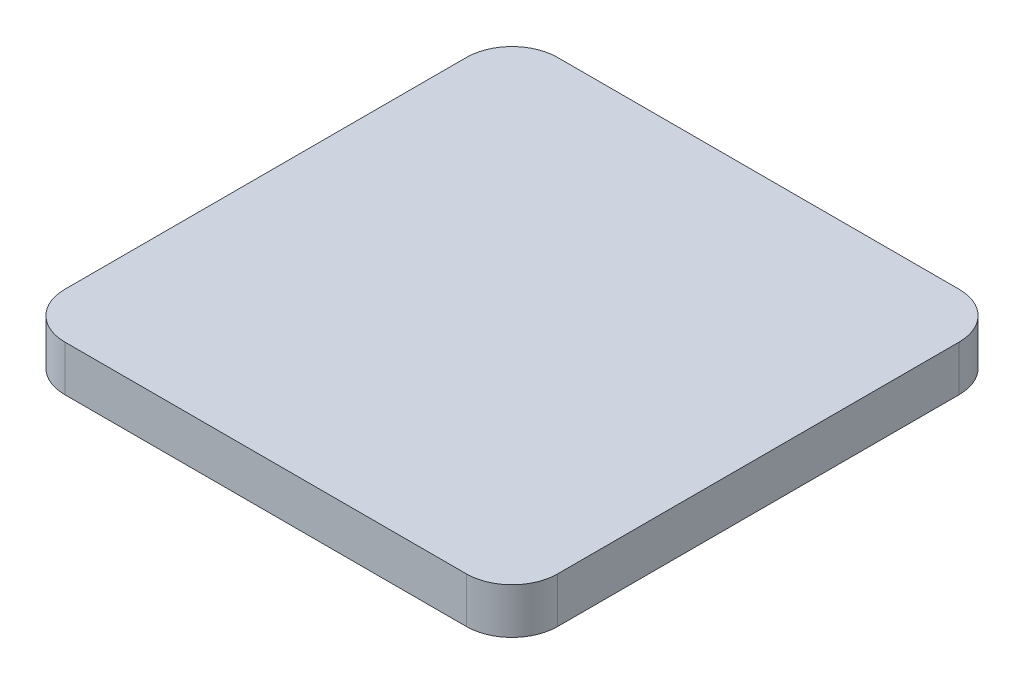
ISO-10303-21;
HEADER;
FILE_DESCRIPTION(('STEP AP214'),'2;1');
FILE_NAME('part.step','',(''),(''),'','','');
FILE_SCHEMA(('AUTOMOTIVE_DESIGN { 1 0 10303 214 1 1 1 1 }'));
ENDSEC;
DATA;
#1=APPLICATION_CONTEXT('core data for automotive mechanical design processes');
#2=APPLICATION_PROTOCOL_DEFINITION('international standard','automotive_design',2000,#1);
#3=PRODUCT_CONTEXT('',#1,'mechanical');
#4=PRODUCT('Part','Part','',(#3));
#5=PRODUCT_RELATED_PRODUCT_CATEGORY('part','',(#4));
#6=PRODUCT_DEFINITION_FORMATION('','',#4);
#7=PRODUCT_DEFINITION_CONTEXT('part definition',#1,'design');
#8=PRODUCT_DEFINITION('design','',#6,#7);
#9=PRODUCT_DEFINITION_SHAPE('','',#8);
#10=(LENGTH_UNIT() NAMED_UNIT(*) SI_UNIT(.MILLI.,.METRE.));
#11=(NAMED_UNIT(*) PLANE_ANGLE_UNIT() SI_UNIT($,.RADIAN.));
#12=(NAMED_UNIT(*) SI_UNIT($,.STERADIAN.) SOLID_ANGLE_UNIT());
#13=UNCERTAINTY_MEASURE_WITH_UNIT(LENGTH_MEASURE(1.E-05),#10,'distance_accuracy_value','');
#14=(GEOMETRIC_REPRESENTATION_CONTEXT(3) GLOBAL_UNCERTAINTY_ASSIGNED_CONTEXT((#13)) GLOBAL_UNIT_ASSIGNED_CONTEXT((#10,
#11,#12)) REPRESENTATION_CONTEXT('',''));
#15=CARTESIAN_POINT('',(0.,0.,0.));
#16=DIRECTION('',(0.,0.,1.));
#17=DIRECTION('',(1.,0.,0.));
#18=AXIS2_PLACEMENT_3D('',#15,#16,#17);
#19=CARTESIAN_POINT('',(27.,5.,-27.));
#20=DIRECTION('',(-1.,0.,0.));
#21=DIRECTION('',(0.,0.,1.));
#22=AXIS2_PLACEMENT_3D('',#19,#20,#21);
#23=PLANE('',#22);
#24=DIRECTION('',(0.,0.,-1.));
#25=VECTOR('',#24,1.);
#26=CARTESIAN_POINT('',(27.,0.,-27.));
#27=LINE('',#26,#25);
#28=CARTESIAN_POINT('',(27.,0.,22.));
#29=VERTEX_POINT('',#28);
#30=CARTESIAN_POINT('',(27.,0.,-22.));
#31=VERTEX_POINT('',#30);
#32=EDGE_CURVE('E184',#29,#31,#27,.T.);
#33=ORIENTED_EDGE('',*,*,#32,.T.);
#34=DIRECTION('',(0.,-1.,0.));
#35=VECTOR('',#34,1.);
#36=CARTESIAN_POINT('',(27.,5.,-22.));
#37=LINE('',#36,#35);
#38=CARTESIAN_POINT('',(27.,5.,-22.));
#39=VERTEX_POINT('',#38);
#40=EDGE_CURVE('E11',#31,#39,#37,.F.);
#41=ORIENTED_EDGE('',*,*,#40,.T.);
#42=DIRECTION('',(0.,0.,-1.));
#43=VECTOR('',#42,1.);
#44=CARTESIAN_POINT('',(27.,5.,-27.));
#45=LINE('',#44,#43);
#46=CARTESIAN_POINT('',(27.,5.,22.));
#47=VERTEX_POINT('',#46);
#48=EDGE_CURVE('E137',#47,#39,#45,.T.);
#49=ORIENTED_EDGE('',*,*,#48,.F.);
#50=DIRECTION('',(0.,-1.,0.));
#51=VECTOR('',#50,1.);
#52=CARTESIAN_POINT('',(27.,5.,22.));
#53=LINE('',#52,#51);
#54=EDGE_CURVE('E50',#47,#29,#53,.T.);
#55=ORIENTED_EDGE('',*,*,#54,.T.);
#56=EDGE_LOOP('',(#33,#41,#49,#55));
#57=FACE_BOUND('',#56,.T.);
#58=ADVANCED_FACE('F41',(#57),#23,.F.);
#59=CARTESIAN_POINT('',(-27.,5.,-27.));
#60=DIRECTION('',(0.,0.,1.));
#61=DIRECTION('',(1.,0.,0.));
#62=AXIS2_PLACEMENT_3D('',#59,#60,#61);
#63=PLANE('',#62);
#64=DIRECTION('',(-1.,0.,0.));
#65=VECTOR('',#64,1.);
#66=CARTESIAN_POINT('',(-27.,0.,-27.));
#67=LINE('',#66,#65);
#68=CARTESIAN_POINT('',(22.,0.,-27.));
#69=VERTEX_POINT('',#68);
#70=CARTESIAN_POINT('',(-22.,0.,-27.));
#71=VERTEX_POINT('',#70);
#72=EDGE_CURVE('E144',#69,#71,#67,.T.);
#73=ORIENTED_EDGE('',*,*,#72,.T.);
#74=DIRECTION('',(0.,-1.,0.));
#75=VECTOR('',#74,1.);
#76=CARTESIAN_POINT('',(-22.,5.,-27.));
#77=LINE('',#76,#75);
#78=CARTESIAN_POINT('',(-22.,5.,-27.));
#79=VERTEX_POINT('',#78);
#80=EDGE_CURVE('E57',#71,#79,#77,.F.);
#81=ORIENTED_EDGE('',*,*,#80,.T.);
#82=DIRECTION('',(-1.,0.,0.));
#83=VECTOR('',#82,1.);
#84=CARTESIAN_POINT('',(-27.,5.,-27.));
#85=LINE('',#84,#83);
#86=CARTESIAN_POINT('',(22.,5.,-27.));
#87=VERTEX_POINT('',#86);
#88=EDGE_CURVE('E142',#87,#79,#85,.T.);
#89=ORIENTED_EDGE('',*,*,#88,.F.);
#90=DIRECTION('',(0.,-1.,0.));
#91=VECTOR('',#90,1.);
#92=CARTESIAN_POINT('',(22.,5.,-27.));
#93=LINE('',#92,#91);
#94=EDGE_CURVE('E173',#87,#69,#93,.T.);
#95=ORIENTED_EDGE('',*,*,#94,.T.);
#96=EDGE_LOOP('',(#73,#81,#89,#95));
#97=FACE_BOUND('',#96,.T.);
#98=ADVANCED_FACE('F209',(#97),#63,.F.);
#99=CARTESIAN_POINT('',(-27.,5.,-27.));
#100=DIRECTION('',(1.,0.,0.));
#101=DIRECTION('',(0.,0.,-1.));
#102=AXIS2_PLACEMENT_3D('',#99,#100,#101);
#103=PLANE('',#102);
#104=DIRECTION('',(0.,0.,1.));
#105=VECTOR('',#104,1.);
#106=CARTESIAN_POINT('',(-27.,0.,-27.));
#107=LINE('',#106,#105);
#108=CARTESIAN_POINT('',(-27.,0.,-22.));
#109=VERTEX_POINT('',#108);
#110=CARTESIAN_POINT('',(-27.,0.,22.));
#111=VERTEX_POINT('',#110);
#112=EDGE_CURVE('E138',#109,#111,#107,.T.);
#113=ORIENTED_EDGE('',*,*,#112,.T.);
#114=DIRECTION('',(0.,-1.,0.));
#115=VECTOR('',#114,1.);
#116=CARTESIAN_POINT('',(-27.,5.,22.));
#117=LINE('',#116,#115);
#118=CARTESIAN_POINT('',(-27.,5.,22.));
#119=VERTEX_POINT('',#118);
#120=EDGE_CURVE('E113',#111,#119,#117,.F.);
#121=ORIENTED_EDGE('',*,*,#120,.T.);
#122=DIRECTION('',(0.,0.,1.));
#123=VECTOR('',#122,1.);
#124=CARTESIAN_POINT('',(-27.,5.,-27.));
#125=LINE('',#124,#123);
#126=CARTESIAN_POINT('',(-27.,5.,-22.));
#127=VERTEX_POINT('',#126);
#128=EDGE_CURVE('E195',#127,#119,#125,.T.);
#129=ORIENTED_EDGE('',*,*,#128,.F.);
#130=DIRECTION('',(0.,-1.,0.));
#131=VECTOR('',#130,1.);
#132=CARTESIAN_POINT('',(-27.,5.,-22.));
#133=LINE('',#132,#131);
#134=EDGE_CURVE('E119',#127,#109,#133,.T.);
#135=ORIENTED_EDGE('',*,*,#134,.T.);
#136=EDGE_LOOP('',(#113,#121,#129,#135));
#137=FACE_BOUND('',#136,.T.);
#138=ADVANCED_FACE('F208',(#137),#103,.F.);
#139=CARTESIAN_POINT('',(-27.,5.,27.));
#140=DIRECTION('',(0.,0.,-1.));
#141=DIRECTION('',(-1.,0.,0.));
#142=AXIS2_PLACEMENT_3D('',#139,#140,#141);
#143=PLANE('',#142);
#144=DIRECTION('',(1.,0.,0.));
#145=VECTOR('',#144,1.);
#146=CARTESIAN_POINT('',(-27.,5.,27.));
#147=LINE('',#146,#145);
#148=CARTESIAN_POINT('',(-22.,5.,27.));
#149=VERTEX_POINT('',#148);
#150=CARTESIAN_POINT('',(22.,5.,27.));
#151=VERTEX_POINT('',#150);
#152=EDGE_CURVE('E129',#149,#151,#147,.T.);
#153=ORIENTED_EDGE('',*,*,#152,.F.);
#154=DIRECTION('',(0.,-1.,0.));
#155=VECTOR('',#154,1.);
#156=CARTESIAN_POINT('',(-22.,5.,27.));
#157=LINE('',#156,#155);
#158=CARTESIAN_POINT('',(-22.,0.,27.));
#159=VERTEX_POINT('',#158);
#160=EDGE_CURVE('E112',#149,#159,#157,.T.);
#161=ORIENTED_EDGE('',*,*,#160,.T.);
#162=DIRECTION('',(1.,0.,0.));
#163=VECTOR('',#162,1.);
#164=CARTESIAN_POINT('',(-27.,0.,27.));
#165=LINE('',#164,#163);
#166=CARTESIAN_POINT('',(22.,0.,27.));
#167=VERTEX_POINT('',#166);
#168=EDGE_CURVE('E126',#159,#167,#165,.T.);
#169=ORIENTED_EDGE('',*,*,#168,.T.);
#170=DIRECTION('',(0.,-1.,0.));
#171=VECTOR('',#170,1.);
#172=CARTESIAN_POINT('',(22.,5.,27.));
#173=LINE('',#172,#171);
#174=EDGE_CURVE('E132',#167,#151,#173,.F.);
#175=ORIENTED_EDGE('',*,*,#174,.T.);
#176=EDGE_LOOP('',(#153,#161,#169,#175));
#177=FACE_BOUND('',#176,.T.);
#178=ADVANCED_FACE('F125',(#177),#143,.F.);
#179=CARTESIAN_POINT('',(0.,5.,0.));
#180=DIRECTION('',(0.,1.,0.));
#181=DIRECTION('',(0.,0.,1.));
#182=AXIS2_PLACEMENT_3D('',#179,#180,#181);
#183=PLANE('',#182);
#184=ORIENTED_EDGE('',*,*,#128,.T.);
#185=CARTESIAN_POINT('',(-22.,5.,22.));
#186=DIRECTION('',(0.,1.,0.));
#187=DIRECTION('',(0.,0.,1.));
#188=AXIS2_PLACEMENT_3D('',#185,#186,#187);
#189=CIRCLE('',#188,5.);
#190=EDGE_CURVE('E170',#119,#149,#189,.T.);
#191=ORIENTED_EDGE('',*,*,#190,.T.);
#192=ORIENTED_EDGE('',*,*,#152,.T.);
#193=CARTESIAN_POINT('',(22.,5.,22.));
#194=DIRECTION('',(0.,1.,0.));
#195=DIRECTION('',(0.,0.,1.));
#196=AXIS2_PLACEMENT_3D('',#193,#194,#195);
#197=CIRCLE('',#196,5.);
#198=EDGE_CURVE('E162',#151,#47,#197,.T.);
#199=ORIENTED_EDGE('',*,*,#198,.T.);
#200=ORIENTED_EDGE('',*,*,#48,.T.);
#201=CARTESIAN_POINT('',(22.,5.,-22.));
#202=DIRECTION('',(0.,1.,0.));
#203=DIRECTION('',(0.,0.,1.));
#204=AXIS2_PLACEMENT_3D('',#201,#202,#203);
#205=CIRCLE('',#204,5.);
#206=EDGE_CURVE('E64',#39,#87,#205,.T.);
#207=ORIENTED_EDGE('',*,*,#206,.T.);
#208=ORIENTED_EDGE('',*,*,#88,.T.);
#209=CARTESIAN_POINT('',(-22.,5.,-22.));
#210=DIRECTION('',(0.,1.,0.));
#211=DIRECTION('',(0.,0.,1.));
#212=AXIS2_PLACEMENT_3D('',#209,#210,#211);
#213=CIRCLE('',#212,5.);
#214=EDGE_CURVE('E167',#79,#127,#213,.T.);
#215=ORIENTED_EDGE('',*,*,#214,.T.);
#216=EDGE_LOOP('',(#184,#191,#192,#199,#200,#207,#208,#215));
#217=FACE_BOUND('',#216,.T.);
#218=ADVANCED_FACE('F201',(#217),#183,.T.);
#219=CARTESIAN_POINT('',(0.,0.,0.));
#220=DIRECTION('',(0.,1.,0.));
#221=DIRECTION('',(0.,0.,1.));
#222=AXIS2_PLACEMENT_3D('',#219,#220,#221);
#223=PLANE('',#222);
#224=ORIENTED_EDGE('',*,*,#168,.F.);
#225=CARTESIAN_POINT('',(-22.,0.,22.));
#226=DIRECTION('',(0.,1.,0.));
#227=DIRECTION('',(0.,0.,1.));
#228=AXIS2_PLACEMENT_3D('',#225,#226,#227);
#229=CIRCLE('',#228,5.);
#230=EDGE_CURVE('E108',#159,#111,#229,.F.);
#231=ORIENTED_EDGE('',*,*,#230,.T.);
#232=ORIENTED_EDGE('',*,*,#112,.F.);
#233=CARTESIAN_POINT('',(-22.,0.,-22.));
#234=DIRECTION('',(0.,1.,0.));
#235=DIRECTION('',(0.,0.,1.));
#236=AXIS2_PLACEMENT_3D('',#233,#234,#235);
#237=CIRCLE('',#236,5.);
#238=EDGE_CURVE('E120',#109,#71,#237,.F.);
#239=ORIENTED_EDGE('',*,*,#238,.T.);
#240=ORIENTED_EDGE('',*,*,#72,.F.);
#241=CARTESIAN_POINT('',(22.,0.,-22.));
#242=DIRECTION('',(0.,1.,0.));
#243=DIRECTION('',(0.,0.,1.));
#244=AXIS2_PLACEMENT_3D('',#241,#242,#243);
#245=CIRCLE('',#244,5.);
#246=EDGE_CURVE('E152',#69,#31,#245,.F.);
#247=ORIENTED_EDGE('',*,*,#246,.T.);
#248=ORIENTED_EDGE('',*,*,#32,.F.);
#249=CARTESIAN_POINT('',(22.,0.,22.));
#250=DIRECTION('',(0.,1.,0.));
#251=DIRECTION('',(0.,0.,1.));
#252=AXIS2_PLACEMENT_3D('',#249,#250,#251);
#253=CIRCLE('',#252,5.);
#254=EDGE_CURVE('E131',#29,#167,#253,.F.);
#255=ORIENTED_EDGE('',*,*,#254,.T.);
#256=EDGE_LOOP('',(#224,#231,#232,#239,#240,#247,#248,#255));
#257=FACE_BOUND('',#256,.T.);
#258=ADVANCED_FACE('F134',(#257),#223,.F.);
#259=CARTESIAN_POINT('',(-22.,5.,22.));
#260=DIRECTION('',(0.,-1.,0.));
#261=DIRECTION('',(0.,0.,-1.));
#262=AXIS2_PLACEMENT_3D('',#259,#260,#261);
#263=CYLINDRICAL_SURFACE('',#262,5.);
#264=ORIENTED_EDGE('',*,*,#190,.F.);
#265=ORIENTED_EDGE('',*,*,#120,.F.);
#266=ORIENTED_EDGE('',*,*,#230,.F.);
#267=ORIENTED_EDGE('',*,*,#160,.F.);
#268=EDGE_LOOP('',(#264,#265,#266,#267));
#269=FACE_BOUND('',#268,.T.);
#270=ADVANCED_FACE('F111',(#269),#263,.T.);
#271=CARTESIAN_POINT('',(-22.,5.,-22.));
#272=DIRECTION('',(0.,-1.,0.));
#273=DIRECTION('',(0.,0.,-1.));
#274=AXIS2_PLACEMENT_3D('',#271,#272,#273);
#275=CYLINDRICAL_SURFACE('',#274,5.);
#276=ORIENTED_EDGE('',*,*,#214,.F.);
#277=ORIENTED_EDGE('',*,*,#80,.F.);
#278=ORIENTED_EDGE('',*,*,#238,.F.);
#279=ORIENTED_EDGE('',*,*,#134,.F.);
#280=EDGE_LOOP('',(#276,#277,#278,#279));
#281=FACE_BOUND('',#280,.T.);
#282=ADVANCED_FACE('F206',(#281),#275,.T.);
#283=CARTESIAN_POINT('',(22.,5.,-22.));
#284=DIRECTION('',(0.,-1.,0.));
#285=DIRECTION('',(0.,0.,-1.));
#286=AXIS2_PLACEMENT_3D('',#283,#284,#285);
#287=CYLINDRICAL_SURFACE('',#286,5.);
#288=ORIENTED_EDGE('',*,*,#206,.F.);
#289=ORIENTED_EDGE('',*,*,#40,.F.);
#290=ORIENTED_EDGE('',*,*,#246,.F.);
#291=ORIENTED_EDGE('',*,*,#94,.F.);
#292=EDGE_LOOP('',(#288,#289,#290,#291));
#293=FACE_BOUND('',#292,.T.);
#294=ADVANCED_FACE('F211',(#293),#287,.T.);
#295=CARTESIAN_POINT('',(22.,5.,22.));
#296=DIRECTION('',(0.,-1.,0.));
#297=DIRECTION('',(0.,0.,-1.));
#298=AXIS2_PLACEMENT_3D('',#295,#296,#297);
#299=CYLINDRICAL_SURFACE('',#298,5.);
#300=ORIENTED_EDGE('',*,*,#198,.F.);
#301=ORIENTED_EDGE('',*,*,#174,.F.);
#302=ORIENTED_EDGE('',*,*,#254,.F.);
#303=ORIENTED_EDGE('',*,*,#54,.F.);
#304=EDGE_LOOP('',(#300,#301,#302,#303));
#305=FACE_BOUND('',#304,.T.);
#306=ADVANCED_FACE('F43',(#305),#299,.T.);
#307=CLOSED_SHELL('',(#58,#98,#138,#178,#218,#258,#270,#282,#294,#306));
#308=MANIFOLD_SOLID_BREP('B2',#307);
#309=ADVANCED_BREP_SHAPE_REPRESENTATION('',(#18,#308),#14);
#310=SHAPE_DEFINITION_REPRESENTATION(#9,#309);
ENDSEC;
END-ISO-10303-21;
